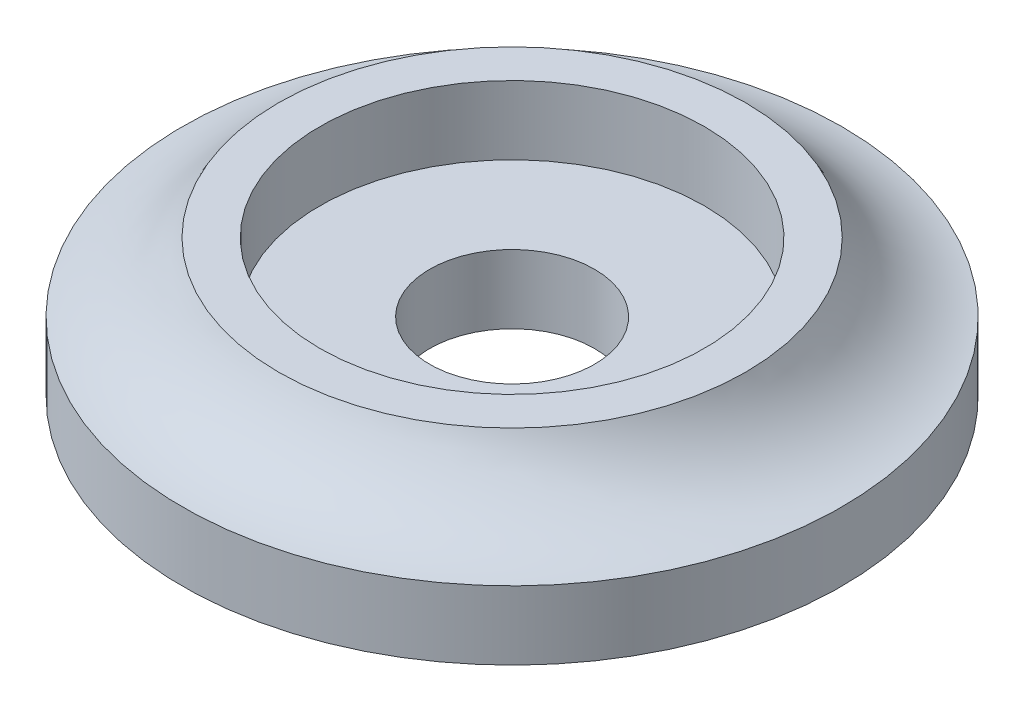
ISO-10303-21;
HEADER;
FILE_DESCRIPTION(('STEP AP214'),'2;1');
FILE_NAME('part.step','',(''),(''),'','','');
FILE_SCHEMA(('AUTOMOTIVE_DESIGN { 1 0 10303 214 1 1 1 1 }'));
ENDSEC;
DATA;
#1=APPLICATION_CONTEXT('core data for automotive mechanical design processes');
#2=APPLICATION_PROTOCOL_DEFINITION('international standard','automotive_design',2000,#1);
#3=PRODUCT_CONTEXT('',#1,'mechanical');
#4=PRODUCT('Part','Part','',(#3));
#5=PRODUCT_RELATED_PRODUCT_CATEGORY('part','',(#4));
#6=PRODUCT_DEFINITION_FORMATION('','',#4);
#7=PRODUCT_DEFINITION_CONTEXT('part definition',#1,'design');
#8=PRODUCT_DEFINITION('design','',#6,#7);
#9=PRODUCT_DEFINITION_SHAPE('','',#8);
#10=(LENGTH_UNIT() NAMED_UNIT(*) SI_UNIT(.MILLI.,.METRE.));
#11=(NAMED_UNIT(*) PLANE_ANGLE_UNIT() SI_UNIT($,.RADIAN.));
#12=(NAMED_UNIT(*) SI_UNIT($,.STERADIAN.) SOLID_ANGLE_UNIT());
#13=UNCERTAINTY_MEASURE_WITH_UNIT(LENGTH_MEASURE(1.E-05),#10,'distance_accuracy_value','');
#14=(GEOMETRIC_REPRESENTATION_CONTEXT(3) GLOBAL_UNCERTAINTY_ASSIGNED_CONTEXT((#13)) GLOBAL_UNIT_ASSIGNED_CONTEXT((#10,
#11,#12)) REPRESENTATION_CONTEXT('',''));
#15=CARTESIAN_POINT('',(0.,0.,0.));
#16=DIRECTION('',(0.,0.,1.));
#17=DIRECTION('',(1.,0.,0.));
#18=AXIS2_PLACEMENT_3D('',#15,#16,#17);
#19=CARTESIAN_POINT('',(0.,0.,0.));
#20=DIRECTION('',(0.,-1.,0.));
#21=DIRECTION('',(0.,0.,-1.));
#22=AXIS2_PLACEMENT_3D('',#19,#20,#21);
#23=CYLINDRICAL_SURFACE('',#22,12.);
#24=CARTESIAN_POINT('',(0.,2.5,0.));
#25=DIRECTION('',(0.,-1.,0.));
#26=DIRECTION('',(0.,0.,-1.));
#27=AXIS2_PLACEMENT_3D('',#24,#25,#26);
#28=CIRCLE('',#27,12.);
#29=CARTESIAN_POINT('',(0.,2.5,-12.));
#30=VERTEX_POINT('',#29);
#31=EDGE_CURVE('E10',#30,#30,#28,.T.);
#32=ORIENTED_EDGE('',*,*,#31,.T.);
#33=EDGE_LOOP('',(#32));
#34=FACE_BOUND('',#33,.T.);
#35=CARTESIAN_POINT('',(0.,0.,0.));
#36=DIRECTION('',(0.,-1.,0.));
#37=DIRECTION('',(0.,0.,-1.));
#38=AXIS2_PLACEMENT_3D('',#35,#36,#37);
#39=CIRCLE('',#38,12.);
#40=CARTESIAN_POINT('',(0.,0.,-12.));
#41=VERTEX_POINT('',#40);
#42=EDGE_CURVE('E58',#41,#41,#39,.T.);
#43=ORIENTED_EDGE('',*,*,#42,.F.);
#44=EDGE_LOOP('',(#43));
#45=FACE_BOUND('',#44,.T.);
#46=ADVANCED_FACE('F33',(#34,#45),#23,.T.);
#47=CARTESIAN_POINT('',(0.,6.97791170237741,0.));
#48=DIRECTION('',(0.,-1.,0.));
#49=DIRECTION('',(0.,0.,-1.));
#50=AXIS2_PLACEMENT_3D('',#47,#48,#49);
#51=TOROIDAL_SURFACE('',#50,12.5556512159839,4.51225459034759);
#52=CARTESIAN_POINT('',(0.,5.,0.));
#53=DIRECTION('',(0.,-1.,0.));
#54=DIRECTION('',(0.,0.,-1.));
#55=AXIS2_PLACEMENT_3D('',#52,#53,#54);
#56=CIRCLE('',#55,8.5);
#57=CARTESIAN_POINT('',(0.,5.,-8.5));
#58=VERTEX_POINT('',#57);
#59=EDGE_CURVE('E39',#58,#58,#56,.T.);
#60=ORIENTED_EDGE('',*,*,#59,.T.);
#61=EDGE_LOOP('',(#60));
#62=FACE_BOUND('',#61,.T.);
#63=ORIENTED_EDGE('',*,*,#31,.F.);
#64=EDGE_LOOP('',(#63));
#65=FACE_BOUND('',#64,.T.);
#66=ADVANCED_FACE('F66',(#62,#65),#51,.F.);
#67=CARTESIAN_POINT('',(0.,5.,0.));
#68=DIRECTION('',(0.,-1.,0.));
#69=DIRECTION('',(0.,0.,-1.));
#70=AXIS2_PLACEMENT_3D('',#67,#68,#69);
#71=PLANE('',#70);
#72=ORIENTED_EDGE('',*,*,#59,.F.);
#73=EDGE_LOOP('',(#72));
#74=FACE_BOUND('',#73,.T.);
#75=CARTESIAN_POINT('',(0.,5.,0.));
#76=DIRECTION('',(0.,-1.,0.));
#77=DIRECTION('',(0.,0.,-1.));
#78=AXIS2_PLACEMENT_3D('',#75,#76,#77);
#79=CIRCLE('',#78,7.);
#80=CARTESIAN_POINT('',(0.,5.,-7.));
#81=VERTEX_POINT('',#80);
#82=EDGE_CURVE('E43',#81,#81,#79,.T.);
#83=ORIENTED_EDGE('',*,*,#82,.T.);
#84=EDGE_LOOP('',(#83));
#85=FACE_BOUND('',#84,.T.);
#86=ADVANCED_FACE('F70',(#74,#85),#71,.F.);
#87=CARTESIAN_POINT('',(0.,0.,0.));
#88=DIRECTION('',(0.,-1.,0.));
#89=DIRECTION('',(0.,0.,-1.));
#90=AXIS2_PLACEMENT_3D('',#87,#88,#89);
#91=CYLINDRICAL_SURFACE('',#90,7.);
#92=CARTESIAN_POINT('',(0.,2.5,0.));
#93=DIRECTION('',(0.,-1.,0.));
#94=DIRECTION('',(0.,0.,-1.));
#95=AXIS2_PLACEMENT_3D('',#92,#93,#94);
#96=CIRCLE('',#95,7.);
#97=CARTESIAN_POINT('',(0.,2.5,-7.));
#98=VERTEX_POINT('',#97);
#99=EDGE_CURVE('E47',#98,#98,#96,.T.);
#100=ORIENTED_EDGE('',*,*,#99,.T.);
#101=EDGE_LOOP('',(#100));
#102=FACE_BOUND('',#101,.T.);
#103=ORIENTED_EDGE('',*,*,#82,.F.);
#104=EDGE_LOOP('',(#103));
#105=FACE_BOUND('',#104,.T.);
#106=ADVANCED_FACE('F74',(#102,#105),#91,.F.);
#107=CARTESIAN_POINT('',(0.,2.5,0.));
#108=DIRECTION('',(0.,-1.,0.));
#109=DIRECTION('',(0.,0.,-1.));
#110=AXIS2_PLACEMENT_3D('',#107,#108,#109);
#111=PLANE('',#110);
#112=ORIENTED_EDGE('',*,*,#99,.F.);
#113=EDGE_LOOP('',(#112));
#114=FACE_BOUND('',#113,.T.);
#115=CARTESIAN_POINT('',(0.,2.5,0.));
#116=DIRECTION('',(0.,-1.,0.));
#117=DIRECTION('',(0.,0.,-1.));
#118=AXIS2_PLACEMENT_3D('',#115,#116,#117);
#119=CIRCLE('',#118,3.);
#120=CARTESIAN_POINT('',(0.,2.5,-3.));
#121=VERTEX_POINT('',#120);
#122=EDGE_CURVE('E52',#121,#121,#119,.T.);
#123=ORIENTED_EDGE('',*,*,#122,.T.);
#124=EDGE_LOOP('',(#123));
#125=FACE_BOUND('',#124,.T.);
#126=ADVANCED_FACE('F81',(#114,#125),#111,.F.);
#127=CARTESIAN_POINT('',(0.,0.,0.));
#128=DIRECTION('',(0.,-1.,0.));
#129=DIRECTION('',(0.,0.,-1.));
#130=AXIS2_PLACEMENT_3D('',#127,#128,#129);
#131=CYLINDRICAL_SURFACE('',#130,3.);
#132=CARTESIAN_POINT('',(0.,0.,0.));
#133=DIRECTION('',(0.,-1.,0.));
#134=DIRECTION('',(0.,0.,-1.));
#135=AXIS2_PLACEMENT_3D('',#132,#133,#134);
#136=CIRCLE('',#135,3.);
#137=CARTESIAN_POINT('',(0.,0.,-3.));
#138=VERTEX_POINT('',#137);
#139=EDGE_CURVE('E55',#138,#138,#136,.T.);
#140=ORIENTED_EDGE('',*,*,#139,.T.);
#141=EDGE_LOOP('',(#140));
#142=FACE_BOUND('',#141,.T.);
#143=ORIENTED_EDGE('',*,*,#122,.F.);
#144=EDGE_LOOP('',(#143));
#145=FACE_BOUND('',#144,.T.);
#146=ADVANCED_FACE('F85',(#142,#145),#131,.F.);
#147=CARTESIAN_POINT('',(0.,0.,0.));
#148=DIRECTION('',(0.,-1.,0.));
#149=DIRECTION('',(0.,0.,-1.));
#150=AXIS2_PLACEMENT_3D('',#147,#148,#149);
#151=PLANE('',#150);
#152=ORIENTED_EDGE('',*,*,#42,.T.);
#153=EDGE_LOOP('',(#152));
#154=FACE_BOUND('',#153,.T.);
#155=ORIENTED_EDGE('',*,*,#139,.F.);
#156=EDGE_LOOP('',(#155));
#157=FACE_BOUND('',#156,.T.);
#158=ADVANCED_FACE('F62',(#154,#157),#151,.T.);
#159=CLOSED_SHELL('',(#46,#66,#86,#106,#126,#146,#158));
#160=MANIFOLD_SOLID_BREP('B2',#159);
#161=ADVANCED_BREP_SHAPE_REPRESENTATION('',(#18,#160),#14);
#162=SHAPE_DEFINITION_REPRESENTATION(#9,#161);
ENDSEC;
END-ISO-10303-21;
